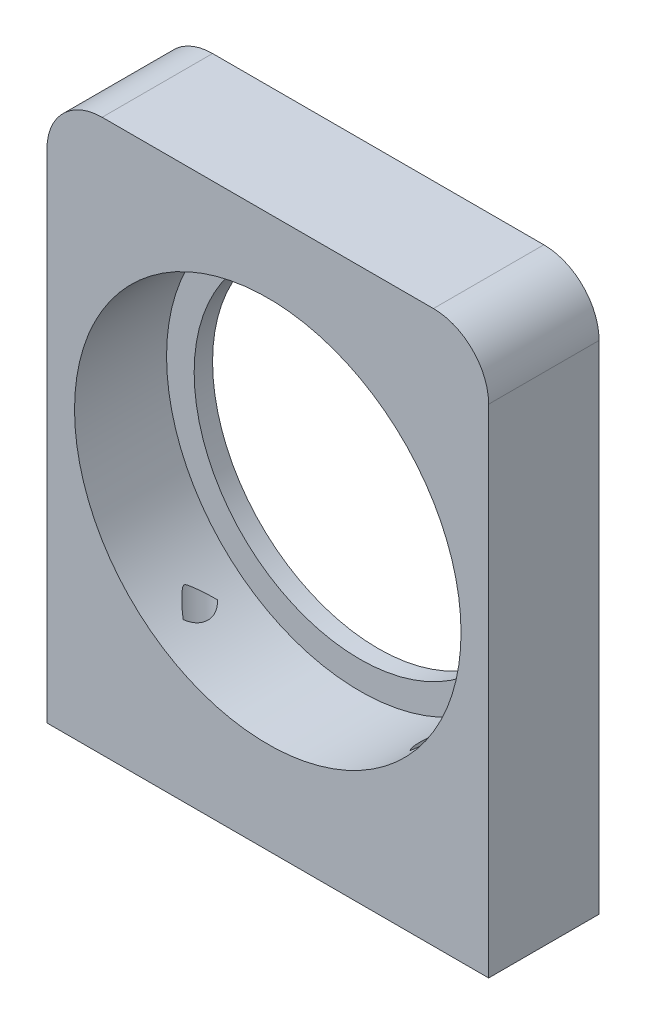
ISO-10303-21;
HEADER;
FILE_DESCRIPTION(('STEP AP214'),'2;1');
FILE_NAME('part.step','',(''),(''),'','','');
FILE_SCHEMA(('AUTOMOTIVE_DESIGN { 1 0 10303 214 1 1 1 1 }'));
ENDSEC;
DATA;
#1=APPLICATION_CONTEXT('core data for automotive mechanical design processes');
#2=APPLICATION_PROTOCOL_DEFINITION('international standard','automotive_design',2000,#1);
#3=PRODUCT_CONTEXT('',#1,'mechanical');
#4=PRODUCT('Part','Part','',(#3));
#5=PRODUCT_RELATED_PRODUCT_CATEGORY('part','',(#4));
#6=PRODUCT_DEFINITION_FORMATION('','',#4);
#7=PRODUCT_DEFINITION_CONTEXT('part definition',#1,'design');
#8=PRODUCT_DEFINITION('design','',#6,#7);
#9=PRODUCT_DEFINITION_SHAPE('','',#8);
#10=(LENGTH_UNIT() NAMED_UNIT(*) SI_UNIT(.MILLI.,.METRE.));
#11=(NAMED_UNIT(*) PLANE_ANGLE_UNIT() SI_UNIT($,.RADIAN.));
#12=(NAMED_UNIT(*) SI_UNIT($,.STERADIAN.) SOLID_ANGLE_UNIT());
#13=UNCERTAINTY_MEASURE_WITH_UNIT(LENGTH_MEASURE(1.E-05),#10,'distance_accuracy_value','');
#14=(GEOMETRIC_REPRESENTATION_CONTEXT(3) GLOBAL_UNCERTAINTY_ASSIGNED_CONTEXT((#13)) GLOBAL_UNIT_ASSIGNED_CONTEXT((#10,
#11,#12)) REPRESENTATION_CONTEXT('',''));
#15=CARTESIAN_POINT('',(0.,0.,0.));
#16=DIRECTION('',(0.,0.,1.));
#17=DIRECTION('',(1.,0.,0.));
#18=AXIS2_PLACEMENT_3D('',#15,#16,#17);
#19=CARTESIAN_POINT('',(-12.,0.,3.));
#20=DIRECTION('',(0.,1.,0.));
#21=DIRECTION('',(0.,0.,1.));
#22=AXIS2_PLACEMENT_3D('',#19,#20,#21);
#23=PLANE('',#22);
#24=DIRECTION('',(1.,0.,0.));
#25=VECTOR('',#24,1.);
#26=CARTESIAN_POINT('',(-12.,0.,-3.));
#27=LINE('',#26,#25);
#28=CARTESIAN_POINT('',(-12.,0.,-3.));
#29=VERTEX_POINT('',#28);
#30=CARTESIAN_POINT('',(12.,0.,-3.));
#31=VERTEX_POINT('',#30);
#32=EDGE_CURVE('E157',#29,#31,#27,.T.);
#33=ORIENTED_EDGE('',*,*,#32,.T.);
#34=DIRECTION('',(0.,0.,-1.));
#35=VECTOR('',#34,1.);
#36=CARTESIAN_POINT('',(12.,0.,3.));
#37=LINE('',#36,#35);
#38=CARTESIAN_POINT('',(12.,0.,3.));
#39=VERTEX_POINT('',#38);
#40=EDGE_CURVE('E155',#39,#31,#37,.T.);
#41=ORIENTED_EDGE('',*,*,#40,.F.);
#42=DIRECTION('',(1.,0.,0.));
#43=VECTOR('',#42,1.);
#44=CARTESIAN_POINT('',(-12.,0.,3.));
#45=LINE('',#44,#43);
#46=CARTESIAN_POINT('',(-12.,0.,3.));
#47=VERTEX_POINT('',#46);
#48=EDGE_CURVE('E146',#47,#39,#45,.T.);
#49=ORIENTED_EDGE('',*,*,#48,.F.);
#50=DIRECTION('',(0.,0.,-1.));
#51=VECTOR('',#50,1.);
#52=CARTESIAN_POINT('',(-12.,0.,3.));
#53=LINE('',#52,#51);
#54=EDGE_CURVE('E166',#47,#29,#53,.T.);
#55=ORIENTED_EDGE('',*,*,#54,.T.);
#56=EDGE_LOOP('',(#33,#41,#49,#55));
#57=FACE_BOUND('',#56,.T.);
#58=CARTESIAN_POINT('',(-7.,0.,0.500000000000002));
#59=DIRECTION('',(0.,-1.,0.));
#60=DIRECTION('',(0.,0.,-1.));
#61=AXIS2_PLACEMENT_3D('',#58,#59,#60);
#62=CIRCLE('',#61,1.25);
#63=CARTESIAN_POINT('',(-7.,0.,-0.749999999999998));
#64=VERTEX_POINT('',#63);
#65=EDGE_CURVE('E114',#64,#64,#62,.T.);
#66=ORIENTED_EDGE('',*,*,#65,.F.);
#67=EDGE_LOOP('',(#66));
#68=FACE_BOUND('',#67,.T.);
#69=CARTESIAN_POINT('',(7.,0.,0.500000000000002));
#70=DIRECTION('',(0.,-1.,0.));
#71=DIRECTION('',(0.,0.,-1.));
#72=AXIS2_PLACEMENT_3D('',#69,#70,#71);
#73=CIRCLE('',#72,1.25);
#74=CARTESIAN_POINT('',(7.,0.,-0.749999999999998));
#75=VERTEX_POINT('',#74);
#76=EDGE_CURVE('E115',#75,#75,#73,.T.);
#77=ORIENTED_EDGE('',*,*,#76,.F.);
#78=EDGE_LOOP('',(#77));
#79=FACE_BOUND('',#78,.T.);
#80=ADVANCED_FACE('F41',(#57,#68,#79),#23,.F.);
#81=CARTESIAN_POINT('',(-12.,30.,3.));
#82=DIRECTION('',(1.,0.,0.));
#83=DIRECTION('',(0.,1.,0.));
#84=AXIS2_PLACEMENT_3D('',#81,#82,#83);
#85=PLANE('',#84);
#86=DIRECTION('',(0.,-1.,0.));
#87=VECTOR('',#86,1.);
#88=CARTESIAN_POINT('',(-12.,30.,3.));
#89=LINE('',#88,#87);
#90=CARTESIAN_POINT('',(-12.,27.,3.));
#91=VERTEX_POINT('',#90);
#92=EDGE_CURVE('E144',#91,#47,#89,.T.);
#93=ORIENTED_EDGE('',*,*,#92,.F.);
#94=DIRECTION('',(0.,0.,-1.));
#95=VECTOR('',#94,1.);
#96=CARTESIAN_POINT('',(-12.,27.,3.));
#97=LINE('',#96,#95);
#98=CARTESIAN_POINT('',(-12.,27.,-3.));
#99=VERTEX_POINT('',#98);
#100=EDGE_CURVE('E184',#91,#99,#97,.T.);
#101=ORIENTED_EDGE('',*,*,#100,.T.);
#102=DIRECTION('',(0.,-1.,0.));
#103=VECTOR('',#102,1.);
#104=CARTESIAN_POINT('',(-12.,30.,-3.));
#105=LINE('',#104,#103);
#106=EDGE_CURVE('E136',#99,#29,#105,.T.);
#107=ORIENTED_EDGE('',*,*,#106,.T.);
#108=ORIENTED_EDGE('',*,*,#54,.F.);
#109=EDGE_LOOP('',(#93,#101,#107,#108));
#110=FACE_BOUND('',#109,.T.);
#111=ADVANCED_FACE('F217',(#110),#85,.F.);
#112=CARTESIAN_POINT('',(12.,30.,3.));
#113=DIRECTION('',(-1.,0.,0.));
#114=DIRECTION('',(0.,-1.,0.));
#115=AXIS2_PLACEMENT_3D('',#112,#113,#114);
#116=PLANE('',#115);
#117=DIRECTION('',(0.,1.,0.));
#118=VECTOR('',#117,1.);
#119=CARTESIAN_POINT('',(12.,30.,-3.));
#120=LINE('',#119,#118);
#121=CARTESIAN_POINT('',(12.,27.,-3.));
#122=VERTEX_POINT('',#121);
#123=EDGE_CURVE('E159',#31,#122,#120,.T.);
#124=ORIENTED_EDGE('',*,*,#123,.T.);
#125=DIRECTION('',(0.,0.,-1.));
#126=VECTOR('',#125,1.);
#127=CARTESIAN_POINT('',(12.,27.,3.));
#128=LINE('',#127,#126);
#129=CARTESIAN_POINT('',(12.,27.,3.));
#130=VERTEX_POINT('',#129);
#131=EDGE_CURVE('E178',#122,#130,#128,.F.);
#132=ORIENTED_EDGE('',*,*,#131,.T.);
#133=DIRECTION('',(0.,1.,0.));
#134=VECTOR('',#133,1.);
#135=CARTESIAN_POINT('',(12.,30.,3.));
#136=LINE('',#135,#134);
#137=EDGE_CURVE('E149',#39,#130,#136,.T.);
#138=ORIENTED_EDGE('',*,*,#137,.F.);
#139=ORIENTED_EDGE('',*,*,#40,.T.);
#140=EDGE_LOOP('',(#124,#132,#138,#139));
#141=FACE_BOUND('',#140,.T.);
#142=ADVANCED_FACE('F223',(#141),#116,.F.);
#143=CARTESIAN_POINT('',(-12.,30.,3.));
#144=DIRECTION('',(0.,-1.,0.));
#145=DIRECTION('',(0.,0.,-1.));
#146=AXIS2_PLACEMENT_3D('',#143,#144,#145);
#147=PLANE('',#146);
#148=DIRECTION('',(-1.,0.,0.));
#149=VECTOR('',#148,1.);
#150=CARTESIAN_POINT('',(-12.,30.,3.));
#151=LINE('',#150,#149);
#152=CARTESIAN_POINT('',(9.00000000000001,30.,3.));
#153=VERTEX_POINT('',#152);
#154=CARTESIAN_POINT('',(-9.00000000000001,30.,3.));
#155=VERTEX_POINT('',#154);
#156=EDGE_CURVE('E152',#153,#155,#151,.T.);
#157=ORIENTED_EDGE('',*,*,#156,.F.);
#158=DIRECTION('',(0.,0.,-1.));
#159=VECTOR('',#158,1.);
#160=CARTESIAN_POINT('',(9.00000000000001,30.,3.));
#161=LINE('',#160,#159);
#162=CARTESIAN_POINT('',(9.00000000000001,30.,-3.));
#163=VERTEX_POINT('',#162);
#164=EDGE_CURVE('E171',#153,#163,#161,.T.);
#165=ORIENTED_EDGE('',*,*,#164,.T.);
#166=DIRECTION('',(-1.,0.,0.));
#167=VECTOR('',#166,1.);
#168=CARTESIAN_POINT('',(-12.,30.,-3.));
#169=LINE('',#168,#167);
#170=CARTESIAN_POINT('',(-9.00000000000001,30.,-3.));
#171=VERTEX_POINT('',#170);
#172=EDGE_CURVE('E147',#163,#171,#169,.T.);
#173=ORIENTED_EDGE('',*,*,#172,.T.);
#174=DIRECTION('',(0.,0.,-1.));
#175=VECTOR('',#174,1.);
#176=CARTESIAN_POINT('',(-9.00000000000001,30.,3.));
#177=LINE('',#176,#175);
#178=EDGE_CURVE('E168',#171,#155,#177,.F.);
#179=ORIENTED_EDGE('',*,*,#178,.T.);
#180=EDGE_LOOP('',(#157,#165,#173,#179));
#181=FACE_BOUND('',#180,.T.);
#182=ADVANCED_FACE('F244',(#181),#147,.F.);
#183=CARTESIAN_POINT('',(0.,0.,3.));
#184=DIRECTION('',(0.,0.,1.));
#185=DIRECTION('',(1.,0.,0.));
#186=AXIS2_PLACEMENT_3D('',#183,#184,#185);
#187=PLANE('',#186);
#188=CARTESIAN_POINT('',(0.,15.5,3.));
#189=DIRECTION('',(0.,0.,1.));
#190=DIRECTION('',(1.,0.,0.));
#191=AXIS2_PLACEMENT_3D('',#188,#189,#190);
#192=CIRCLE('',#191,10.5);
#193=CARTESIAN_POINT('',(10.5,15.5,3.));
#194=VERTEX_POINT('',#193);
#195=EDGE_CURVE('E132',#194,#194,#192,.T.);
#196=ORIENTED_EDGE('',*,*,#195,.F.);
#197=EDGE_LOOP('',(#196));
#198=FACE_BOUND('',#197,.T.);
#199=ORIENTED_EDGE('',*,*,#137,.T.);
#200=CARTESIAN_POINT('',(9.00000000000001,27.,3.));
#201=DIRECTION('',(0.,0.,1.));
#202=DIRECTION('',(1.,0.,0.));
#203=AXIS2_PLACEMENT_3D('',#200,#201,#202);
#204=CIRCLE('',#203,3.);
#205=EDGE_CURVE('E182',#130,#153,#204,.T.);
#206=ORIENTED_EDGE('',*,*,#205,.T.);
#207=ORIENTED_EDGE('',*,*,#156,.T.);
#208=CARTESIAN_POINT('',(-9.00000000000001,27.,3.));
#209=DIRECTION('',(0.,0.,1.));
#210=DIRECTION('',(1.,0.,0.));
#211=AXIS2_PLACEMENT_3D('',#208,#209,#210);
#212=CIRCLE('',#211,3.);
#213=EDGE_CURVE('E180',#155,#91,#212,.T.);
#214=ORIENTED_EDGE('',*,*,#213,.T.);
#215=ORIENTED_EDGE('',*,*,#92,.T.);
#216=ORIENTED_EDGE('',*,*,#48,.T.);
#217=EDGE_LOOP('',(#199,#206,#207,#214,#215,#216));
#218=FACE_BOUND('',#217,.T.);
#219=ADVANCED_FACE('F240',(#198,#218),#187,.T.);
#220=CARTESIAN_POINT('',(0.,0.,-3.));
#221=DIRECTION('',(0.,0.,1.));
#222=DIRECTION('',(1.,0.,0.));
#223=AXIS2_PLACEMENT_3D('',#220,#221,#222);
#224=PLANE('',#223);
#225=CARTESIAN_POINT('',(0.,15.5,-3.));
#226=DIRECTION('',(0.,0.,1.));
#227=DIRECTION('',(1.,0.,0.));
#228=AXIS2_PLACEMENT_3D('',#225,#226,#227);
#229=CIRCLE('',#228,9.);
#230=CARTESIAN_POINT('',(9.,15.5,-3.));
#231=VERTEX_POINT('',#230);
#232=EDGE_CURVE('E139',#231,#231,#229,.T.);
#233=ORIENTED_EDGE('',*,*,#232,.T.);
#234=EDGE_LOOP('',(#233));
#235=FACE_BOUND('',#234,.T.);
#236=ORIENTED_EDGE('',*,*,#172,.F.);
#237=CARTESIAN_POINT('',(9.00000000000001,27.,-3.));
#238=DIRECTION('',(0.,0.,1.));
#239=DIRECTION('',(1.,0.,0.));
#240=AXIS2_PLACEMENT_3D('',#237,#238,#239);
#241=CIRCLE('',#240,3.);
#242=EDGE_CURVE('E176',#163,#122,#241,.F.);
#243=ORIENTED_EDGE('',*,*,#242,.T.);
#244=ORIENTED_EDGE('',*,*,#123,.F.);
#245=ORIENTED_EDGE('',*,*,#32,.F.);
#246=ORIENTED_EDGE('',*,*,#106,.F.);
#247=CARTESIAN_POINT('',(-9.00000000000001,27.,-3.));
#248=DIRECTION('',(0.,0.,1.));
#249=DIRECTION('',(1.,0.,0.));
#250=AXIS2_PLACEMENT_3D('',#247,#248,#249);
#251=CIRCLE('',#250,3.);
#252=EDGE_CURVE('E174',#99,#171,#251,.F.);
#253=ORIENTED_EDGE('',*,*,#252,.T.);
#254=EDGE_LOOP('',(#236,#243,#244,#245,#246,#253));
#255=FACE_BOUND('',#254,.T.);
#256=ADVANCED_FACE('F121',(#235,#255),#224,.F.);
#257=CARTESIAN_POINT('',(0.,15.5,-32.698484809835));
#258=DIRECTION('',(0.,0.,1.));
#259=DIRECTION('',(1.,0.,0.));
#260=AXIS2_PLACEMENT_3D('',#257,#258,#259);
#261=CYLINDRICAL_SURFACE('',#260,10.5);
#262=CARTESIAN_POINT('',(6.05921611706959,6.92469242262156,-0.503227865505491));
#263=CARTESIAN_POINT('',(6.10486105320645,6.95694547941683,-0.47244261360208));
#264=CARTESIAN_POINT('',(6.14979553762071,6.98924128396704,-0.440674312319421));
#265=CARTESIAN_POINT('',(6.23829323925263,7.05389413383631,-0.375351288295883));
#266=CARTESIAN_POINT('',(6.28185659590143,7.08625117257135,-0.341796748139177));
#267=CARTESIAN_POINT('',(6.4105778098151,7.18338739050366,-0.23871375887191));
#268=CARTESIAN_POINT('',(6.49376717900657,7.24823193238876,-0.166765689351883));
#269=CARTESIAN_POINT('',(6.6196585992544,7.34932564199338,-0.050038354128474));
#270=CARTESIAN_POINT('',(6.66411743791511,7.38564450186102,-0.00718108013156022));
#271=CARTESIAN_POINT('',(6.75137895868239,7.45810418672181,0.0803264711137914));
#272=CARTESIAN_POINT('',(6.79418204541987,7.49424505330454,0.124976304793269));
#273=CARTESIAN_POINT('',(6.85751597052806,7.54856710564296,0.194452303437213));
#274=CARTESIAN_POINT('',(6.87880192352752,7.56697654017578,0.218416351231926));
#275=CARTESIAN_POINT('',(6.92066303001161,7.6034698656382,0.267244292477927));
#276=CARTESIAN_POINT('',(6.94123790464866,7.62155362755418,0.292108531283438));
#277=CARTESIAN_POINT('',(6.97130072445786,7.64817515617683,0.331021514931715));
#278=CARTESIAN_POINT('',(6.98130186672074,7.6570671343631,0.344430778550847));
#279=CARTESIAN_POINT('',(7.00067943425234,7.67435925775917,0.372006777392051));
#280=CARTESIAN_POINT('',(7.0100565043142,7.68275990948559,0.386172702658892));
#281=CARTESIAN_POINT('',(7.02284598388213,7.69425433012281,0.408085646776221));
#282=CARTESIAN_POINT('',(7.02679300157929,7.69780766305458,0.415271410212403));
#283=CARTESIAN_POINT('',(7.03418839365098,7.70447448446511,0.430108954720464));
#284=CARTESIAN_POINT('',(7.03763665845488,7.70758787629011,0.437760837670638));
#285=CARTESIAN_POINT('',(7.0429631602257,7.71240218759569,0.451765270967571));
#286=CARTESIAN_POINT('',(7.04501967837265,7.71426286036597,0.457991668871886));
#287=CARTESIAN_POINT('',(7.04838915531056,7.7173130881751,0.470796943970181));
#288=CARTESIAN_POINT('',(7.04970459293693,7.71850488049656,0.477374564544338));
#289=CARTESIAN_POINT('',(7.05119879069973,7.71985883741954,0.489611044166168));
#290=CARTESIAN_POINT('',(7.05153388375151,7.72016260478847,0.495233846703689));
#291=CARTESIAN_POINT('',(7.05145992594374,7.72009557179046,0.506467890688682));
#292=CARTESIAN_POINT('',(7.05105114682925,7.7197250177609,0.512079135608629));
#293=CARTESIAN_POINT('',(7.04935849265292,7.71819131588639,0.524648988974748));
#294=CARTESIAN_POINT('',(7.0478651274495,7.71683845183145,0.531554432369281));
#295=CARTESIAN_POINT('',(7.04409573445752,7.71342683396471,0.544974345148223));
#296=CARTESIAN_POINT('',(7.04181626200191,7.71136497349761,0.551486943014879));
#297=CARTESIAN_POINT('',(7.0355806860588,7.70573101360186,0.567066823034114));
#298=CARTESIAN_POINT('',(7.03133704060565,7.70190175519311,0.575920105092638));
#299=CARTESIAN_POINT('',(7.02225686185606,7.69372390851042,0.593074052251252));
#300=CARTESIAN_POINT('',(7.01741872158279,7.68937391349008,0.60137312158972));
#301=CARTESIAN_POINT('',(7.00735305488288,7.68034212809568,0.617640104143171));
#302=CARTESIAN_POINT('',(7.00212299904102,7.67565819396256,0.625605235651502));
#303=CARTESIAN_POINT('',(6.99143567074487,7.66610704738056,0.641244677359));
#304=CARTESIAN_POINT('',(6.98597872662034,7.66124010068201,0.648919379069237));
#305=CARTESIAN_POINT('',(6.9673696601379,7.64467920179921,0.674380328915435));
#306=CARTESIAN_POINT('',(6.95385053243376,7.63270715651241,0.691715211361979));
#307=CARTESIAN_POINT('',(6.92632342664832,7.60846132373929,0.725777980811389));
#308=CARTESIAN_POINT('',(6.9123152290973,7.59618740153545,0.74250558824959));
#309=CARTESIAN_POINT('',(6.86974371405666,7.55909097676948,0.792122780409073));
#310=CARTESIAN_POINT('',(6.84067225795111,7.5340283858145,0.824396921261556));
#311=CARTESIAN_POINT('',(6.78174633508676,7.48380306107422,0.887740218552146));
#312=CARTESIAN_POINT('',(6.75189635041314,7.458641402726,0.918814460540686));
#313=CARTESIAN_POINT('',(6.6913962767872,7.40822860518545,0.980035167077466));
#314=CARTESIAN_POINT('',(6.66074683346604,7.38297755161216,1.01018233990525));
#315=CARTESIAN_POINT('',(6.58542278782151,7.32164634257547,1.08229307549367));
#316=CARTESIAN_POINT('',(6.54034198082607,7.28554108401475,1.12381211961261));
#317=CARTESIAN_POINT('',(6.44857225760649,7.21330420162568,1.205051152916));
#318=CARTESIAN_POINT('',(6.40188281849265,7.17717257303341,1.24477054721986));
#319=CARTESIAN_POINT('',(6.3068512751119,7.10493049759973,1.3222550763318));
#320=CARTESIAN_POINT('',(6.25850859236139,7.06882006276408,1.36001951522225));
#321=CARTESIAN_POINT('',(6.16014096601173,6.99668428048186,1.43333709558463));
#322=CARTESIAN_POINT('',(6.11011645408733,6.96065891370348,1.46889079790998));
#323=CARTESIAN_POINT('',(6.05921611706981,6.92469242262169,1.50322786550585));
#324=B_SPLINE_CURVE_WITH_KNOTS('',3,(#262,#263,#264,#265,#266,#267,#268,#269,#270,#271,#272,
#273,#274,#275,#276,#277,#278,#279,#280,#281,#282,#283,#284,#285,#286,#287,#288,#289,#290,#291,
#292,#293,#294,#295,#296,#297,#298,#299,#300,#301,#302,#303,#304,#305,#306,#307,#308,#309,#310,
#311,#312,#313,#314,#315,#316,#317,#318,#319,#320,#321,#322,#323),.UNSPECIFIED.,.F.,.F.,(4,2,2,
2,2,2,2,2,2,2,2,2,2,2,2,2,2,2,2,2,2,2,2,2,2,2,2,2,2,2,4),(0.,0.19139132162741,0.382763117212276,
0.765505161837761,0.980402298765987,1.19524658324619,1.30613120297721,1.41705882351254,
1.47388534003584,1.53065220127842,1.55743815414859,1.58422998269489,1.60462300040051,
1.62494739435485,1.64178370195973,1.65861386030204,1.68006591251788,1.70161318632801,
1.73314130831661,1.7647566103002,1.7965972354527,1.82839328694428,1.90345541269556,
1.97855166676217,2.12895989262036,2.27863854676027,2.42819985249475,2.64155304035104,
2.85497624587839,3.06847490980187,3.2819191872564),.UNSPECIFIED.);
#325=CARTESIAN_POINT('',(6.16441400296898,7.,-0.429675234458605));
#326=VERTEX_POINT('',#325);
#327=CARTESIAN_POINT('',(6.16441400296898,7.,1.42967523445861));
#328=VERTEX_POINT('',#327);
#329=EDGE_CURVE('E54',#326,#328,#324,.T.);
#330=ORIENTED_EDGE('',*,*,#329,.T.);
#331=CARTESIAN_POINT('',(6.16441400296898,7.,1.42967523445861));
#332=CARTESIAN_POINT('',(6.14160997523051,6.9834612836014,1.40917743392536));
#333=CARTESIAN_POINT('',(6.11935076010904,6.96745916890939,1.3876542646745));
#334=CARTESIAN_POINT('',(6.07610749386707,6.93661155028095,1.34255644233385));
#335=CARTESIAN_POINT('',(6.05512440571601,6.92176691745857,1.31898027188086));
#336=CARTESIAN_POINT('',(5.99423789448783,6.87900389500257,1.2450003711109));
#337=CARTESIAN_POINT('',(5.95660412013881,6.85300552566752,1.19152812051929));
#338=CARTESIAN_POINT('',(5.88920889116575,6.80696234504912,1.07712412592013));
#339=CARTESIAN_POINT('',(5.85948433709675,6.78694538854271,1.01615929166955));
#340=CARTESIAN_POINT('',(5.81001217341295,6.75387790861765,0.888690736665007));
#341=CARTESIAN_POINT('',(5.79023726487781,6.74080831802179,0.822202761047473));
#342=CARTESIAN_POINT('',(5.76333459969168,6.72308664546705,0.692613265285483));
#343=CARTESIAN_POINT('',(5.75515038316578,6.71773052315736,0.629826129120366));
#344=CARTESIAN_POINT('',(5.74840635308286,6.71331440135924,0.503481892667003));
#345=CARTESIAN_POINT('',(5.74984927515127,6.71425619147121,0.439924578648431));
#346=CARTESIAN_POINT('',(5.76185963949073,6.7221291783462,0.318364013408503));
#347=CARTESIAN_POINT('',(5.77181477188729,6.72865847372068,0.260272218846751));
#348=CARTESIAN_POINT('',(5.79949987643052,6.74693918787866,0.146863999917961));
#349=CARTESIAN_POINT('',(5.81722714061768,6.75868878782717,0.091546616367248));
#350=CARTESIAN_POINT('',(5.86008902512891,6.78736359727553,-0.016285362570731));
#351=CARTESIAN_POINT('',(5.88538857820261,6.80440440184434,-0.0687030087487993));
#352=CARTESIAN_POINT('',(5.9421039088272,6.8430620227002,-0.168314012157876));
#353=CARTESIAN_POINT('',(5.97352447263177,6.86468242111043,-0.215503235490311));
#354=CARTESIAN_POINT('',(6.03141432901525,6.90506546336778,-0.291144812033296));
#355=CARTESIAN_POINT('',(6.0566840391339,6.92284370057407,-0.32106680128241));
#356=CARTESIAN_POINT('',(6.1091742050928,6.96015033537605,-0.377733962335069));
#357=CARTESIAN_POINT('',(6.1363876783141,6.97967252581669,-0.404489670570347));
#358=CARTESIAN_POINT('',(6.16441400296898,7.,-0.429675234458607));
#359=B_SPLINE_CURVE_WITH_KNOTS('',3,(#331,#332,#333,#334,#335,#336,#337,#338,#339,#340,#341,
#342,#343,#344,#345,#346,#347,#348,#349,#350,#351,#352,#353,#354,#355,#356,#357,#358),
.UNSPECIFIED.,.F.,.F.,(4,2,2,2,2,2,2,2,2,2,2,2,2,4),(0.,0.104470275097494,0.209018429884959,
0.419045778041351,0.630036480454924,0.840445085401436,1.03006645526582,1.21974170979441,
1.39682089970803,1.57383844081244,1.75503339442118,1.93637060418892,2.06521603074546,
2.19361986534914),.UNSPECIFIED.);
#360=EDGE_CURVE('E12',#328,#326,#359,.T.);
#361=ORIENTED_EDGE('',*,*,#360,.T.);
#362=EDGE_LOOP('',(#330,#361));
#363=FACE_BOUND('',#362,.T.);
#364=CARTESIAN_POINT('',(-6.05921611706958,6.92469242262155,1.5032278655055));
#365=CARTESIAN_POINT('',(-6.10486105320645,6.95694547941683,1.47244261360209));
#366=CARTESIAN_POINT('',(-6.1497955376207,6.98924128396703,1.44067431231943));
#367=CARTESIAN_POINT('',(-6.23829323925263,7.05389413383631,1.37535128829589));
#368=CARTESIAN_POINT('',(-6.28185659590143,7.08625117257134,1.34179674813918));
#369=CARTESIAN_POINT('',(-6.4105778098151,7.18338739050366,1.23871375887191));
#370=CARTESIAN_POINT('',(-6.49376717900657,7.24823193238876,1.16676568935189));
#371=CARTESIAN_POINT('',(-6.6196585992544,7.34932564199338,1.05003835412848));
#372=CARTESIAN_POINT('',(-6.6641174379151,7.38564450186102,1.00718108013156));
#373=CARTESIAN_POINT('',(-6.75137895868239,7.45810418672181,0.919673528886213));
#374=CARTESIAN_POINT('',(-6.79418204541987,7.49424505330454,0.875023695206735));
#375=CARTESIAN_POINT('',(-6.85751597052806,7.54856710564296,0.805547696562791));
#376=CARTESIAN_POINT('',(-6.87880192352752,7.56697654017578,0.781583648768077));
#377=CARTESIAN_POINT('',(-6.92066303001161,7.6034698656382,0.732755707522077));
#378=CARTESIAN_POINT('',(-6.94123790464866,7.62155362755418,0.707891468716566));
#379=CARTESIAN_POINT('',(-6.97130072445786,7.64817515617683,0.668978485068289));
#380=CARTESIAN_POINT('',(-6.98130186672074,7.6570671343631,0.655569221449157));
#381=CARTESIAN_POINT('',(-7.00067943425234,7.67435925775917,0.627993222607953));
#382=CARTESIAN_POINT('',(-7.0100565043142,7.68275990948559,0.613827297341112));
#383=CARTESIAN_POINT('',(-7.02284598388213,7.69425433012281,0.591914353223783));
#384=CARTESIAN_POINT('',(-7.02679300157929,7.69780766305458,0.5847285897876));
#385=CARTESIAN_POINT('',(-7.03418839365098,7.70447448446511,0.569891045279539));
#386=CARTESIAN_POINT('',(-7.03763665845488,7.70758787629011,0.562239162329366));
#387=CARTESIAN_POINT('',(-7.0429631602257,7.71240218759569,0.548234729032431));
#388=CARTESIAN_POINT('',(-7.04501967837265,7.71426286036597,0.542008331128117));
#389=CARTESIAN_POINT('',(-7.04838915531056,7.7173130881751,0.529203056029821));
#390=CARTESIAN_POINT('',(-7.04970459293693,7.71850488049656,0.522625435455665));
#391=CARTESIAN_POINT('',(-7.05119879069973,7.71985883741954,0.510388955833835));
#392=CARTESIAN_POINT('',(-7.05153388375151,7.72016260478847,0.504766153296314));
#393=CARTESIAN_POINT('',(-7.05145992594374,7.72009557179046,0.493532109311322));
#394=CARTESIAN_POINT('',(-7.05105114682925,7.7197250177609,0.487920864391374));
#395=CARTESIAN_POINT('',(-7.04935849265292,7.71819131588639,0.475351011025255));
#396=CARTESIAN_POINT('',(-7.0478651274495,7.71683845183144,0.468445567630722));
#397=CARTESIAN_POINT('',(-7.04409573445752,7.71342683396471,0.45502565485178));
#398=CARTESIAN_POINT('',(-7.04181626200191,7.71136497349761,0.448513056985124));
#399=CARTESIAN_POINT('',(-7.0355806860588,7.70573101360186,0.432933176965889));
#400=CARTESIAN_POINT('',(-7.03133704060565,7.70190175519311,0.424079894907365));
#401=CARTESIAN_POINT('',(-7.02225686185606,7.69372390851042,0.406925947748751));
#402=CARTESIAN_POINT('',(-7.01741872158278,7.68937391349008,0.398626878410283));
#403=CARTESIAN_POINT('',(-7.00735305488288,7.68034212809568,0.382359895856832));
#404=CARTESIAN_POINT('',(-7.00212299904102,7.67565819396255,0.374394764348501));
#405=CARTESIAN_POINT('',(-6.99143567074487,7.66610704738055,0.358755322641002));
#406=CARTESIAN_POINT('',(-6.98597872662034,7.66124010068201,0.351080620930766));
#407=CARTESIAN_POINT('',(-6.96736966013789,7.64467920179921,0.325619671084569));
#408=CARTESIAN_POINT('',(-6.95385053243376,7.63270715651241,0.308284788638023));
#409=CARTESIAN_POINT('',(-6.92632342664832,7.60846132373928,0.274222019188612));
#410=CARTESIAN_POINT('',(-6.9123152290973,7.59618740153544,0.257494411750411));
#411=CARTESIAN_POINT('',(-6.86974371405666,7.55909097676948,0.207877219590928));
#412=CARTESIAN_POINT('',(-6.84067225795111,7.5340283858145,0.175603078738444));
#413=CARTESIAN_POINT('',(-6.78174633508676,7.48380306107422,0.112259781447853));
#414=CARTESIAN_POINT('',(-6.75189635041314,7.458641402726,0.0811855394593147));
#415=CARTESIAN_POINT('',(-6.6913962767872,7.40822860518545,0.0199648329225369));
#416=CARTESIAN_POINT('',(-6.66074683346604,7.38297755161216,-0.0101823399052471));
#417=CARTESIAN_POINT('',(-6.58542278782151,7.32164634257547,-0.0822930754936708));
#418=CARTESIAN_POINT('',(-6.54034198082607,7.28554108401475,-0.123812119612605));
#419=CARTESIAN_POINT('',(-6.44857225760649,7.21330420162569,-0.205051152915993));
#420=CARTESIAN_POINT('',(-6.40188281849265,7.17717257303341,-0.244770547219858));
#421=CARTESIAN_POINT('',(-6.3068512751119,7.10493049759973,-0.322255076331795));
#422=CARTESIAN_POINT('',(-6.2585085923614,7.06882006276408,-0.360019515222241));
#423=CARTESIAN_POINT('',(-6.16014096601173,6.99668428048186,-0.433337095584617));
#424=CARTESIAN_POINT('',(-6.11011645408733,6.96065891370348,-0.468890797909969));
#425=CARTESIAN_POINT('',(-6.05921611706981,6.92469242262169,-0.503227865505845));
#426=B_SPLINE_CURVE_WITH_KNOTS('',3,(#364,#365,#366,#367,#368,#369,#370,#371,#372,#373,#374,
#375,#376,#377,#378,#379,#380,#381,#382,#383,#384,#385,#386,#387,#388,#389,#390,#391,#392,#393,
#394,#395,#396,#397,#398,#399,#400,#401,#402,#403,#404,#405,#406,#407,#408,#409,#410,#411,#412,
#413,#414,#415,#416,#417,#418,#419,#420,#421,#422,#423,#424,#425),.UNSPECIFIED.,.F.,.F.,(4,2,2,
2,2,2,2,2,2,2,2,2,2,2,2,2,2,2,2,2,2,2,2,2,2,2,2,2,2,2,4),(0.,0.191391321627412,
0.382763117212279,0.765505161837766,0.98040229876599,1.19524658324619,1.30613120297721,
1.41705882351254,1.47388534003584,1.53065220127842,1.55743815414859,1.5842299826949,
1.60462300040052,1.62494739435486,1.64178370195974,1.65861386030204,1.68006591251788,
1.70161318632801,1.73314130831662,1.76475661030021,1.79659723545271,1.82839328694429,
1.90345541269557,1.97855166676218,2.12895989262037,2.27863854676028,2.42819985249476,
2.64155304035104,2.85497624587839,3.06847490980187,3.2819191872564),.UNSPECIFIED.);
#427=CARTESIAN_POINT('',(-6.16441400296898,7.,1.42967523445861));
#428=VERTEX_POINT('',#427);
#429=CARTESIAN_POINT('',(-6.16441400296898,7.,-0.429675234458606));
#430=VERTEX_POINT('',#429);
#431=EDGE_CURVE('E125',#428,#430,#426,.T.);
#432=ORIENTED_EDGE('',*,*,#431,.T.);
#433=CARTESIAN_POINT('',(-6.16441400296898,7.,-0.429675234458606));
#434=CARTESIAN_POINT('',(-6.14160997523051,6.9834612836014,-0.409177433925359));
#435=CARTESIAN_POINT('',(-6.11935076010904,6.96745916890939,-0.3876542646745));
#436=CARTESIAN_POINT('',(-6.07610749386707,6.93661155028095,-0.34255644233385));
#437=CARTESIAN_POINT('',(-6.05512440571601,6.92176691745857,-0.318980271880855));
#438=CARTESIAN_POINT('',(-5.99423789448784,6.87900389500257,-0.245000371110893));
#439=CARTESIAN_POINT('',(-5.95660412013881,6.85300552566752,-0.191528120519285));
#440=CARTESIAN_POINT('',(-5.88920889116575,6.80696234504912,-0.0771241259201291));
#441=CARTESIAN_POINT('',(-5.85948433709675,6.78694538854271,-0.016159291669552));
#442=CARTESIAN_POINT('',(-5.81001217341295,6.75387790861765,0.111309263334995));
#443=CARTESIAN_POINT('',(-5.79023726487781,6.74080831802179,0.177797238952529));
#444=CARTESIAN_POINT('',(-5.76333459969168,6.72308664546705,0.307386734714519));
#445=CARTESIAN_POINT('',(-5.75515038316578,6.71773052315736,0.370173870879635));
#446=CARTESIAN_POINT('',(-5.74840635308286,6.71331440135924,0.496518107332999));
#447=CARTESIAN_POINT('',(-5.74984927515127,6.71425619147122,0.560075421351571));
#448=CARTESIAN_POINT('',(-5.76185963949073,6.7221291783462,0.681635986591499));
#449=CARTESIAN_POINT('',(-5.77181477188729,6.72865847372068,0.739727781153251));
#450=CARTESIAN_POINT('',(-5.79949987643052,6.74693918787866,0.853136000082041));
#451=CARTESIAN_POINT('',(-5.81722714061768,6.75868878782717,0.908453383632754));
#452=CARTESIAN_POINT('',(-5.86008902512891,6.78736359727553,1.01628536257073));
#453=CARTESIAN_POINT('',(-5.88538857820261,6.80440440184434,1.0687030087488));
#454=CARTESIAN_POINT('',(-5.9421039088272,6.8430620227002,1.16831401215788));
#455=CARTESIAN_POINT('',(-5.97352447263177,6.86468242111043,1.21550323549031));
#456=CARTESIAN_POINT('',(-6.03141432901525,6.90506546336778,1.2911448120333));
#457=CARTESIAN_POINT('',(-6.0566840391339,6.92284370057407,1.32106680128241));
#458=CARTESIAN_POINT('',(-6.1091742050928,6.96015033537605,1.37773396233507));
#459=CARTESIAN_POINT('',(-6.1363876783141,6.97967252581669,1.40448967057035));
#460=CARTESIAN_POINT('',(-6.16441400296898,7.,1.42967523445861));
#461=B_SPLINE_CURVE_WITH_KNOTS('',3,(#433,#434,#435,#436,#437,#438,#439,#440,#441,#442,#443,
#444,#445,#446,#447,#448,#449,#450,#451,#452,#453,#454,#455,#456,#457,#458,#459,#460),
.UNSPECIFIED.,.F.,.F.,(4,2,2,2,2,2,2,2,2,2,2,2,2,4),(0.,0.104470275097493,0.209018429884958,
0.41904577804135,0.630036480454922,0.840445085401433,1.03006645526582,1.2197417097944,
1.39682089970803,1.57383844081244,1.75503339442118,1.93637060418892,2.06521603074546,
2.19361986534914),.UNSPECIFIED.);
#462=EDGE_CURVE('E111',#430,#428,#461,.T.);
#463=ORIENTED_EDGE('',*,*,#462,.T.);
#464=EDGE_LOOP('',(#432,#463));
#465=FACE_BOUND('',#464,.T.);
#466=CARTESIAN_POINT('',(0.,15.5,-2.));
#467=DIRECTION('',(0.,0.,1.));
#468=DIRECTION('',(1.,0.,0.));
#469=AXIS2_PLACEMENT_3D('',#466,#467,#468);
#470=CIRCLE('',#469,10.5);
#471=CARTESIAN_POINT('',(10.5,15.5,-2.));
#472=VERTEX_POINT('',#471);
#473=EDGE_CURVE('E129',#472,#472,#470,.F.);
#474=ORIENTED_EDGE('',*,*,#473,.T.);
#475=EDGE_LOOP('',(#474));
#476=FACE_BOUND('',#475,.T.);
#477=ORIENTED_EDGE('',*,*,#195,.T.);
#478=EDGE_LOOP('',(#477));
#479=FACE_BOUND('',#478,.T.);
#480=ADVANCED_FACE('F117',(#363,#465,#476,#479),#261,.F.);
#481=CARTESIAN_POINT('',(0.,0.,-2.));
#482=DIRECTION('',(0.,0.,1.));
#483=DIRECTION('',(1.,0.,0.));
#484=AXIS2_PLACEMENT_3D('',#481,#482,#483);
#485=PLANE('',#484);
#486=CARTESIAN_POINT('',(0.,15.5,-2.));
#487=DIRECTION('',(0.,0.,1.));
#488=DIRECTION('',(1.,0.,0.));
#489=AXIS2_PLACEMENT_3D('',#486,#487,#488);
#490=CIRCLE('',#489,9.);
#491=CARTESIAN_POINT('',(9.,15.5,-2.));
#492=VERTEX_POINT('',#491);
#493=EDGE_CURVE('E134',#492,#492,#490,.T.);
#494=ORIENTED_EDGE('',*,*,#493,.F.);
#495=EDGE_LOOP('',(#494));
#496=FACE_BOUND('',#495,.T.);
#497=ORIENTED_EDGE('',*,*,#473,.F.);
#498=EDGE_LOOP('',(#497));
#499=FACE_BOUND('',#498,.T.);
#500=ADVANCED_FACE('F120',(#496,#499),#485,.T.);
#501=CARTESIAN_POINT('',(0.,15.5,-3.));
#502=DIRECTION('',(0.,0.,1.));
#503=DIRECTION('',(1.,0.,0.));
#504=AXIS2_PLACEMENT_3D('',#501,#502,#503);
#505=CYLINDRICAL_SURFACE('',#504,9.);
#506=ORIENTED_EDGE('',*,*,#493,.T.);
#507=EDGE_LOOP('',(#506));
#508=FACE_BOUND('',#507,.T.);
#509=ORIENTED_EDGE('',*,*,#232,.F.);
#510=EDGE_LOOP('',(#509));
#511=FACE_BOUND('',#510,.T.);
#512=ADVANCED_FACE('F206',(#508,#511),#505,.F.);
#513=CARTESIAN_POINT('',(9.00000000000001,27.,3.));
#514=DIRECTION('',(0.,0.,-1.));
#515=DIRECTION('',(-1.,0.,0.));
#516=AXIS2_PLACEMENT_3D('',#513,#514,#515);
#517=CYLINDRICAL_SURFACE('',#516,3.);
#518=ORIENTED_EDGE('',*,*,#205,.F.);
#519=ORIENTED_EDGE('',*,*,#131,.F.);
#520=ORIENTED_EDGE('',*,*,#242,.F.);
#521=ORIENTED_EDGE('',*,*,#164,.F.);
#522=EDGE_LOOP('',(#518,#519,#520,#521));
#523=FACE_BOUND('',#522,.T.);
#524=ADVANCED_FACE('F208',(#523),#517,.T.);
#525=CARTESIAN_POINT('',(-9.00000000000001,27.,3.));
#526=DIRECTION('',(0.,0.,-1.));
#527=DIRECTION('',(-1.,0.,0.));
#528=AXIS2_PLACEMENT_3D('',#525,#526,#527);
#529=CYLINDRICAL_SURFACE('',#528,3.);
#530=ORIENTED_EDGE('',*,*,#213,.F.);
#531=ORIENTED_EDGE('',*,*,#178,.F.);
#532=ORIENTED_EDGE('',*,*,#252,.F.);
#533=ORIENTED_EDGE('',*,*,#100,.F.);
#534=EDGE_LOOP('',(#530,#531,#532,#533));
#535=FACE_BOUND('',#534,.T.);
#536=ADVANCED_FACE('F43',(#535),#529,.T.);
#537=CARTESIAN_POINT('',(-7.,0.,0.500000000000002));
#538=DIRECTION('',(0.,-1.,0.));
#539=DIRECTION('',(0.,0.,-1.));
#540=AXIS2_PLACEMENT_3D('',#537,#538,#539);
#541=CYLINDRICAL_SURFACE('',#540,1.25);
#542=ORIENTED_EDGE('',*,*,#65,.T.);
#543=EDGE_LOOP('',(#542));
#544=FACE_BOUND('',#543,.T.);
#545=CARTESIAN_POINT('',(-7.,7.,0.500000000000002));
#546=DIRECTION('',(0.,-1.,0.));
#547=DIRECTION('',(0.,0.,-1.));
#548=AXIS2_PLACEMENT_3D('',#545,#546,#547);
#549=CIRCLE('',#548,1.25);
#550=EDGE_CURVE('E67',#428,#430,#549,.T.);
#551=ORIENTED_EDGE('',*,*,#550,.F.);
#552=ORIENTED_EDGE('',*,*,#462,.F.);
#553=EDGE_LOOP('',(#551,#552));
#554=FACE_BOUND('',#553,.T.);
#555=ADVANCED_FACE('F203',(#544,#554),#541,.F.);
#556=CARTESIAN_POINT('',(-7.,7.,0.500000000000002));
#557=DIRECTION('',(0.,-1.,0.));
#558=DIRECTION('',(0.,0.,-1.));
#559=AXIS2_PLACEMENT_3D('',#556,#557,#558);
#560=CONICAL_SURFACE('',#559,1.25,1.02974425867665);
#561=ORIENTED_EDGE('',*,*,#550,.T.);
#562=ORIENTED_EDGE('',*,*,#431,.F.);
#563=EDGE_LOOP('',(#561,#562));
#564=FACE_BOUND('',#563,.T.);
#565=ADVANCED_FACE('F199',(#564),#560,.F.);
#566=CARTESIAN_POINT('',(7.,0.,0.500000000000002));
#567=DIRECTION('',(0.,-1.,0.));
#568=DIRECTION('',(0.,0.,-1.));
#569=AXIS2_PLACEMENT_3D('',#566,#567,#568);
#570=CYLINDRICAL_SURFACE('',#569,1.25);
#571=ORIENTED_EDGE('',*,*,#76,.T.);
#572=EDGE_LOOP('',(#571));
#573=FACE_BOUND('',#572,.T.);
#574=CARTESIAN_POINT('',(7.,7.,0.500000000000002));
#575=DIRECTION('',(0.,-1.,0.));
#576=DIRECTION('',(0.,0.,-1.));
#577=AXIS2_PLACEMENT_3D('',#574,#575,#576);
#578=CIRCLE('',#577,1.25);
#579=EDGE_CURVE('E60',#326,#328,#578,.T.);
#580=ORIENTED_EDGE('',*,*,#579,.F.);
#581=ORIENTED_EDGE('',*,*,#360,.F.);
#582=EDGE_LOOP('',(#580,#581));
#583=FACE_BOUND('',#582,.T.);
#584=ADVANCED_FACE('F113',(#573,#583),#570,.F.);
#585=CARTESIAN_POINT('',(7.,7.,0.500000000000002));
#586=DIRECTION('',(0.,-1.,0.));
#587=DIRECTION('',(0.,0.,-1.));
#588=AXIS2_PLACEMENT_3D('',#585,#586,#587);
#589=CONICAL_SURFACE('',#588,1.25,1.02974425867665);
#590=ORIENTED_EDGE('',*,*,#579,.T.);
#591=ORIENTED_EDGE('',*,*,#329,.F.);
#592=EDGE_LOOP('',(#590,#591));
#593=FACE_BOUND('',#592,.T.);
#594=ADVANCED_FACE('F109',(#593),#589,.F.);
#595=CLOSED_SHELL('',(#80,#111,#142,#182,#219,#256,#480,#500,#512,#524,#536,#555,#565,#584,#594));
#596=MANIFOLD_SOLID_BREP('B2',#595);
#597=ADVANCED_BREP_SHAPE_REPRESENTATION('',(#18,#596),#14);
#598=SHAPE_DEFINITION_REPRESENTATION(#9,#597);
ENDSEC;
END-ISO-10303-21;
